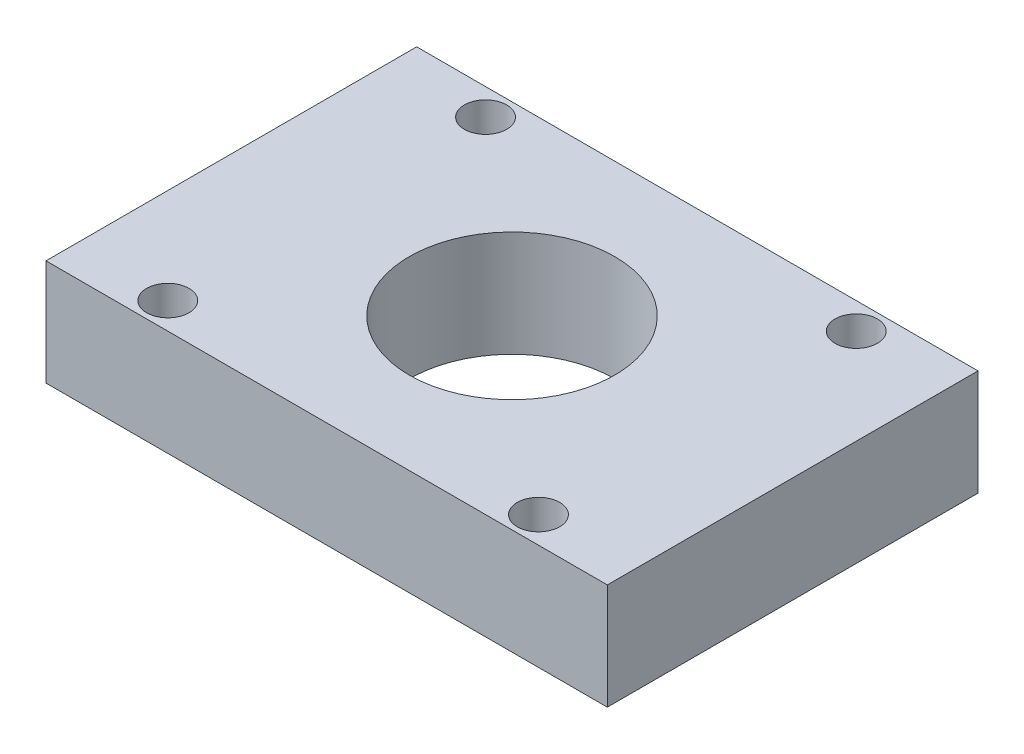
ISO-10303-21;
HEADER;
FILE_DESCRIPTION(('STEP AP214'),'2;1');
FILE_NAME('part.step','',(''),(''),'','','');
FILE_SCHEMA(('AUTOMOTIVE_DESIGN { 1 0 10303 214 1 1 1 1 }'));
ENDSEC;
DATA;
#1=APPLICATION_CONTEXT('core data for automotive mechanical design processes');
#2=APPLICATION_PROTOCOL_DEFINITION('international standard','automotive_design',2000,#1);
#3=PRODUCT_CONTEXT('',#1,'mechanical');
#4=PRODUCT('Part','Part','',(#3));
#5=PRODUCT_RELATED_PRODUCT_CATEGORY('part','',(#4));
#6=PRODUCT_DEFINITION_FORMATION('','',#4);
#7=PRODUCT_DEFINITION_CONTEXT('part definition',#1,'design');
#8=PRODUCT_DEFINITION('design','',#6,#7);
#9=PRODUCT_DEFINITION_SHAPE('','',#8);
#10=(LENGTH_UNIT() NAMED_UNIT(*) SI_UNIT(.MILLI.,.METRE.));
#11=(NAMED_UNIT(*) PLANE_ANGLE_UNIT() SI_UNIT($,.RADIAN.));
#12=(NAMED_UNIT(*) SI_UNIT($,.STERADIAN.) SOLID_ANGLE_UNIT());
#13=UNCERTAINTY_MEASURE_WITH_UNIT(LENGTH_MEASURE(1.E-05),#10,'distance_accuracy_value','');
#14=(GEOMETRIC_REPRESENTATION_CONTEXT(3) GLOBAL_UNCERTAINTY_ASSIGNED_CONTEXT((#13)) GLOBAL_UNIT_ASSIGNED_CONTEXT((#10,
#11,#12)) REPRESENTATION_CONTEXT('',''));
#15=CARTESIAN_POINT('',(0.,0.,0.));
#16=DIRECTION('',(0.,0.,1.));
#17=DIRECTION('',(1.,0.,0.));
#18=AXIS2_PLACEMENT_3D('',#15,#16,#17);
#19=CARTESIAN_POINT('',(26.5,10.,-17.5));
#20=DIRECTION('',(-1.,0.,0.));
#21=DIRECTION('',(0.,0.,1.));
#22=AXIS2_PLACEMENT_3D('',#19,#20,#21);
#23=PLANE('',#22);
#24=DIRECTION('',(0.,0.,-1.));
#25=VECTOR('',#24,1.);
#26=CARTESIAN_POINT('',(26.5,0.,-17.5));
#27=LINE('',#26,#25);
#28=CARTESIAN_POINT('',(26.5,0.,17.5));
#29=VERTEX_POINT('',#28);
#30=CARTESIAN_POINT('',(26.5,0.,-17.5));
#31=VERTEX_POINT('',#30);
#32=EDGE_CURVE('E111',#29,#31,#27,.T.);
#33=ORIENTED_EDGE('',*,*,#32,.T.);
#34=DIRECTION('',(0.,-1.,0.));
#35=VECTOR('',#34,1.);
#36=CARTESIAN_POINT('',(26.5,10.,-17.5));
#37=LINE('',#36,#35);
#38=CARTESIAN_POINT('',(26.5,10.,-17.5));
#39=VERTEX_POINT('',#38);
#40=EDGE_CURVE('E11',#39,#31,#37,.T.);
#41=ORIENTED_EDGE('',*,*,#40,.F.);
#42=DIRECTION('',(0.,0.,-1.));
#43=VECTOR('',#42,1.);
#44=CARTESIAN_POINT('',(26.5,10.,-17.5));
#45=LINE('',#44,#43);
#46=CARTESIAN_POINT('',(26.5,10.,17.5));
#47=VERTEX_POINT('',#46);
#48=EDGE_CURVE('E95',#47,#39,#45,.T.);
#49=ORIENTED_EDGE('',*,*,#48,.F.);
#50=DIRECTION('',(0.,-1.,0.));
#51=VECTOR('',#50,1.);
#52=CARTESIAN_POINT('',(26.5,10.,17.5));
#53=LINE('',#52,#51);
#54=EDGE_CURVE('E107',#47,#29,#53,.T.);
#55=ORIENTED_EDGE('',*,*,#54,.T.);
#56=EDGE_LOOP('',(#33,#41,#49,#55));
#57=FACE_BOUND('',#56,.T.);
#58=ADVANCED_FACE('F43',(#57),#23,.F.);
#59=CARTESIAN_POINT('',(-26.5,10.,-17.5));
#60=DIRECTION('',(0.,0.,1.));
#61=DIRECTION('',(1.,0.,0.));
#62=AXIS2_PLACEMENT_3D('',#59,#60,#61);
#63=PLANE('',#62);
#64=DIRECTION('',(-1.,0.,0.));
#65=VECTOR('',#64,1.);
#66=CARTESIAN_POINT('',(-26.5,0.,-17.5));
#67=LINE('',#66,#65);
#68=CARTESIAN_POINT('',(-26.5,0.,-17.5));
#69=VERTEX_POINT('',#68);
#70=EDGE_CURVE('E100',#31,#69,#67,.T.);
#71=ORIENTED_EDGE('',*,*,#70,.T.);
#72=DIRECTION('',(0.,-1.,0.));
#73=VECTOR('',#72,1.);
#74=CARTESIAN_POINT('',(-26.5,10.,-17.5));
#75=LINE('',#74,#73);
#76=CARTESIAN_POINT('',(-26.5,10.,-17.5));
#77=VERTEX_POINT('',#76);
#78=EDGE_CURVE('E52',#77,#69,#75,.T.);
#79=ORIENTED_EDGE('',*,*,#78,.F.);
#80=DIRECTION('',(-1.,0.,0.));
#81=VECTOR('',#80,1.);
#82=CARTESIAN_POINT('',(-26.5,10.,-17.5));
#83=LINE('',#82,#81);
#84=EDGE_CURVE('E90',#39,#77,#83,.T.);
#85=ORIENTED_EDGE('',*,*,#84,.F.);
#86=ORIENTED_EDGE('',*,*,#40,.T.);
#87=EDGE_LOOP('',(#71,#79,#85,#86));
#88=FACE_BOUND('',#87,.T.);
#89=ADVANCED_FACE('F99',(#88),#63,.F.);
#90=CARTESIAN_POINT('',(-26.5,10.,-17.5));
#91=DIRECTION('',(1.,0.,0.));
#92=DIRECTION('',(0.,0.,-1.));
#93=AXIS2_PLACEMENT_3D('',#90,#91,#92);
#94=PLANE('',#93);
#95=DIRECTION('',(0.,0.,1.));
#96=VECTOR('',#95,1.);
#97=CARTESIAN_POINT('',(-26.5,0.,-17.5));
#98=LINE('',#97,#96);
#99=CARTESIAN_POINT('',(-26.5,0.,17.5));
#100=VERTEX_POINT('',#99);
#101=EDGE_CURVE('E77',#69,#100,#98,.T.);
#102=ORIENTED_EDGE('',*,*,#101,.T.);
#103=DIRECTION('',(0.,-1.,0.));
#104=VECTOR('',#103,1.);
#105=CARTESIAN_POINT('',(-26.5,10.,17.5));
#106=LINE('',#105,#104);
#107=CARTESIAN_POINT('',(-26.5,10.,17.5));
#108=VERTEX_POINT('',#107);
#109=EDGE_CURVE('E102',#108,#100,#106,.T.);
#110=ORIENTED_EDGE('',*,*,#109,.F.);
#111=DIRECTION('',(0.,0.,1.));
#112=VECTOR('',#111,1.);
#113=CARTESIAN_POINT('',(-26.5,10.,-17.5));
#114=LINE('',#113,#112);
#115=EDGE_CURVE('E93',#77,#108,#114,.T.);
#116=ORIENTED_EDGE('',*,*,#115,.F.);
#117=ORIENTED_EDGE('',*,*,#78,.T.);
#118=EDGE_LOOP('',(#102,#110,#116,#117));
#119=FACE_BOUND('',#118,.T.);
#120=ADVANCED_FACE('F103',(#119),#94,.F.);
#121=CARTESIAN_POINT('',(-26.5,10.,17.5));
#122=DIRECTION('',(0.,0.,-1.));
#123=DIRECTION('',(-1.,0.,0.));
#124=AXIS2_PLACEMENT_3D('',#121,#122,#123);
#125=PLANE('',#124);
#126=DIRECTION('',(1.,0.,0.));
#127=VECTOR('',#126,1.);
#128=CARTESIAN_POINT('',(-26.5,0.,17.5));
#129=LINE('',#128,#127);
#130=EDGE_CURVE('E83',#100,#29,#129,.T.);
#131=ORIENTED_EDGE('',*,*,#130,.T.);
#132=ORIENTED_EDGE('',*,*,#54,.F.);
#133=DIRECTION('',(1.,0.,0.));
#134=VECTOR('',#133,1.);
#135=CARTESIAN_POINT('',(-26.5,10.,17.5));
#136=LINE('',#135,#134);
#137=EDGE_CURVE('E60',#108,#47,#136,.T.);
#138=ORIENTED_EDGE('',*,*,#137,.F.);
#139=ORIENTED_EDGE('',*,*,#109,.T.);
#140=EDGE_LOOP('',(#131,#132,#138,#139));
#141=FACE_BOUND('',#140,.T.);
#142=ADVANCED_FACE('F125',(#141),#125,.F.);
#143=CARTESIAN_POINT('',(0.,10.,0.));
#144=DIRECTION('',(0.,1.,0.));
#145=DIRECTION('',(0.,0.,1.));
#146=AXIS2_PLACEMENT_3D('',#143,#144,#145);
#147=PLANE('',#146);
#148=CARTESIAN_POINT('',(17.5,10.,-15.));
#149=DIRECTION('',(0.,1.,0.));
#150=DIRECTION('',(0.,0.,1.));
#151=AXIS2_PLACEMENT_3D('',#148,#149,#150);
#152=CIRCLE('',#151,2.);
#153=CARTESIAN_POINT('',(17.5,10.,-13.));
#154=VERTEX_POINT('',#153);
#155=EDGE_CURVE('E136',#154,#154,#152,.T.);
#156=ORIENTED_EDGE('',*,*,#155,.F.);
#157=EDGE_LOOP('',(#156));
#158=FACE_BOUND('',#157,.T.);
#159=CARTESIAN_POINT('',(-17.5,10.,15.));
#160=DIRECTION('',(0.,1.,0.));
#161=DIRECTION('',(0.,0.,1.));
#162=AXIS2_PLACEMENT_3D('',#159,#160,#161);
#163=CIRCLE('',#162,2.);
#164=CARTESIAN_POINT('',(-17.5,10.,17.));
#165=VERTEX_POINT('',#164);
#166=EDGE_CURVE('E144',#165,#165,#163,.T.);
#167=ORIENTED_EDGE('',*,*,#166,.F.);
#168=EDGE_LOOP('',(#167));
#169=FACE_BOUND('',#168,.T.);
#170=CARTESIAN_POINT('',(17.5,10.,15.));
#171=DIRECTION('',(0.,1.,0.));
#172=DIRECTION('',(0.,0.,1.));
#173=AXIS2_PLACEMENT_3D('',#170,#171,#172);
#174=CIRCLE('',#173,2.);
#175=CARTESIAN_POINT('',(17.5,10.,17.));
#176=VERTEX_POINT('',#175);
#177=EDGE_CURVE('E145',#176,#176,#174,.T.);
#178=ORIENTED_EDGE('',*,*,#177,.F.);
#179=EDGE_LOOP('',(#178));
#180=FACE_BOUND('',#179,.T.);
#181=CARTESIAN_POINT('',(0.,10.,0.));
#182=DIRECTION('',(0.,1.,0.));
#183=DIRECTION('',(0.,0.,1.));
#184=AXIS2_PLACEMENT_3D('',#181,#182,#183);
#185=CIRCLE('',#184,9.69923337418347);
#186=CARTESIAN_POINT('',(0.,10.,9.69923337418347));
#187=VERTEX_POINT('',#186);
#188=EDGE_CURVE('E160',#187,#187,#185,.T.);
#189=ORIENTED_EDGE('',*,*,#188,.F.);
#190=EDGE_LOOP('',(#189));
#191=FACE_BOUND('',#190,.T.);
#192=CARTESIAN_POINT('',(-17.5,10.,-15.));
#193=DIRECTION('',(0.,1.,0.));
#194=DIRECTION('',(0.,0.,1.));
#195=AXIS2_PLACEMENT_3D('',#192,#193,#194);
#196=CIRCLE('',#195,2.);
#197=CARTESIAN_POINT('',(-17.5,10.,-13.));
#198=VERTEX_POINT('',#197);
#199=EDGE_CURVE('E132',#198,#198,#196,.T.);
#200=ORIENTED_EDGE('',*,*,#199,.F.);
#201=EDGE_LOOP('',(#200));
#202=FACE_BOUND('',#201,.T.);
#203=ORIENTED_EDGE('',*,*,#48,.T.);
#204=ORIENTED_EDGE('',*,*,#84,.T.);
#205=ORIENTED_EDGE('',*,*,#115,.T.);
#206=ORIENTED_EDGE('',*,*,#137,.T.);
#207=EDGE_LOOP('',(#203,#204,#205,#206));
#208=FACE_BOUND('',#207,.T.);
#209=ADVANCED_FACE('F91',(#158,#169,#180,#191,#202,#208),#147,.T.);
#210=CARTESIAN_POINT('',(0.,0.,0.));
#211=DIRECTION('',(0.,1.,0.));
#212=DIRECTION('',(0.,0.,1.));
#213=AXIS2_PLACEMENT_3D('',#210,#211,#212);
#214=PLANE('',#213);
#215=CARTESIAN_POINT('',(17.5,0.,-15.));
#216=DIRECTION('',(0.,1.,0.));
#217=DIRECTION('',(0.,0.,1.));
#218=AXIS2_PLACEMENT_3D('',#215,#216,#217);
#219=CIRCLE('',#218,2.);
#220=CARTESIAN_POINT('',(17.5,0.,-13.));
#221=VERTEX_POINT('',#220);
#222=EDGE_CURVE('E149',#221,#221,#219,.T.);
#223=ORIENTED_EDGE('',*,*,#222,.T.);
#224=EDGE_LOOP('',(#223));
#225=FACE_BOUND('',#224,.T.);
#226=CARTESIAN_POINT('',(-17.5,0.,15.));
#227=DIRECTION('',(0.,1.,0.));
#228=DIRECTION('',(0.,0.,1.));
#229=AXIS2_PLACEMENT_3D('',#226,#227,#228);
#230=CIRCLE('',#229,2.);
#231=CARTESIAN_POINT('',(-17.5,0.,17.));
#232=VERTEX_POINT('',#231);
#233=EDGE_CURVE('E140',#232,#232,#230,.T.);
#234=ORIENTED_EDGE('',*,*,#233,.T.);
#235=EDGE_LOOP('',(#234));
#236=FACE_BOUND('',#235,.T.);
#237=CARTESIAN_POINT('',(17.5,0.,15.));
#238=DIRECTION('',(0.,1.,0.));
#239=DIRECTION('',(0.,0.,1.));
#240=AXIS2_PLACEMENT_3D('',#237,#238,#239);
#241=CIRCLE('',#240,2.);
#242=CARTESIAN_POINT('',(17.5,0.,17.));
#243=VERTEX_POINT('',#242);
#244=EDGE_CURVE('E164',#243,#243,#241,.T.);
#245=ORIENTED_EDGE('',*,*,#244,.T.);
#246=EDGE_LOOP('',(#245));
#247=FACE_BOUND('',#246,.T.);
#248=CARTESIAN_POINT('',(0.,0.,0.));
#249=DIRECTION('',(0.,1.,0.));
#250=DIRECTION('',(0.,0.,1.));
#251=AXIS2_PLACEMENT_3D('',#248,#249,#250);
#252=CIRCLE('',#251,9.69923337418347);
#253=CARTESIAN_POINT('',(0.,0.,9.69923337418347));
#254=VERTEX_POINT('',#253);
#255=EDGE_CURVE('E156',#254,#254,#252,.T.);
#256=ORIENTED_EDGE('',*,*,#255,.T.);
#257=EDGE_LOOP('',(#256));
#258=FACE_BOUND('',#257,.T.);
#259=CARTESIAN_POINT('',(-17.5,0.,-15.));
#260=DIRECTION('',(0.,1.,0.));
#261=DIRECTION('',(0.,0.,1.));
#262=AXIS2_PLACEMENT_3D('',#259,#260,#261);
#263=CIRCLE('',#262,2.);
#264=CARTESIAN_POINT('',(-17.5,0.,-13.));
#265=VERTEX_POINT('',#264);
#266=EDGE_CURVE('E115',#265,#265,#263,.T.);
#267=ORIENTED_EDGE('',*,*,#266,.T.);
#268=EDGE_LOOP('',(#267));
#269=FACE_BOUND('',#268,.T.);
#270=ORIENTED_EDGE('',*,*,#32,.F.);
#271=ORIENTED_EDGE('',*,*,#130,.F.);
#272=ORIENTED_EDGE('',*,*,#101,.F.);
#273=ORIENTED_EDGE('',*,*,#70,.F.);
#274=EDGE_LOOP('',(#270,#271,#272,#273));
#275=FACE_BOUND('',#274,.T.);
#276=ADVANCED_FACE('F128',(#225,#236,#247,#258,#269,#275),#214,.F.);
#277=CARTESIAN_POINT('',(-17.5,0.,-15.));
#278=DIRECTION('',(0.,1.,0.));
#279=DIRECTION('',(0.,0.,1.));
#280=AXIS2_PLACEMENT_3D('',#277,#278,#279);
#281=CYLINDRICAL_SURFACE('',#280,2.);
#282=ORIENTED_EDGE('',*,*,#266,.F.);
#283=EDGE_LOOP('',(#282));
#284=FACE_BOUND('',#283,.T.);
#285=ORIENTED_EDGE('',*,*,#199,.T.);
#286=EDGE_LOOP('',(#285));
#287=FACE_BOUND('',#286,.T.);
#288=ADVANCED_FACE('F182',(#284,#287),#281,.F.);
#289=CARTESIAN_POINT('',(0.,0.,0.));
#290=DIRECTION('',(0.,1.,0.));
#291=DIRECTION('',(0.,0.,1.));
#292=AXIS2_PLACEMENT_3D('',#289,#290,#291);
#293=CYLINDRICAL_SURFACE('',#292,9.69923337418347);
#294=ORIENTED_EDGE('',*,*,#255,.F.);
#295=EDGE_LOOP('',(#294));
#296=FACE_BOUND('',#295,.T.);
#297=ORIENTED_EDGE('',*,*,#188,.T.);
#298=EDGE_LOOP('',(#297));
#299=FACE_BOUND('',#298,.T.);
#300=ADVANCED_FACE('F184',(#296,#299),#293,.F.);
#301=CARTESIAN_POINT('',(17.5,0.,15.));
#302=DIRECTION('',(0.,1.,0.));
#303=DIRECTION('',(0.,0.,1.));
#304=AXIS2_PLACEMENT_3D('',#301,#302,#303);
#305=CYLINDRICAL_SURFACE('',#304,2.);
#306=ORIENTED_EDGE('',*,*,#244,.F.);
#307=EDGE_LOOP('',(#306));
#308=FACE_BOUND('',#307,.T.);
#309=ORIENTED_EDGE('',*,*,#177,.T.);
#310=EDGE_LOOP('',(#309));
#311=FACE_BOUND('',#310,.T.);
#312=ADVANCED_FACE('F172',(#308,#311),#305,.F.);
#313=CARTESIAN_POINT('',(-17.5,0.,15.));
#314=DIRECTION('',(0.,1.,0.));
#315=DIRECTION('',(0.,0.,1.));
#316=AXIS2_PLACEMENT_3D('',#313,#314,#315);
#317=CYLINDRICAL_SURFACE('',#316,2.);
#318=ORIENTED_EDGE('',*,*,#233,.F.);
#319=EDGE_LOOP('',(#318));
#320=FACE_BOUND('',#319,.T.);
#321=ORIENTED_EDGE('',*,*,#166,.T.);
#322=EDGE_LOOP('',(#321));
#323=FACE_BOUND('',#322,.T.);
#324=ADVANCED_FACE('F241',(#320,#323),#317,.F.);
#325=CARTESIAN_POINT('',(17.5,0.,-15.));
#326=DIRECTION('',(0.,1.,0.));
#327=DIRECTION('',(0.,0.,1.));
#328=AXIS2_PLACEMENT_3D('',#325,#326,#327);
#329=CYLINDRICAL_SURFACE('',#328,2.);
#330=ORIENTED_EDGE('',*,*,#222,.F.);
#331=EDGE_LOOP('',(#330));
#332=FACE_BOUND('',#331,.T.);
#333=ORIENTED_EDGE('',*,*,#155,.T.);
#334=EDGE_LOOP('',(#333));
#335=FACE_BOUND('',#334,.T.);
#336=ADVANCED_FACE('F252',(#332,#335),#329,.F.);
#337=CLOSED_SHELL('',(#58,#89,#120,#142,#209,#276,#288,#300,#312,#324,#336));
#338=MANIFOLD_SOLID_BREP('B2',#337);
#339=ADVANCED_BREP_SHAPE_REPRESENTATION('',(#18,#338),#14);
#340=SHAPE_DEFINITION_REPRESENTATION(#9,#339);
ENDSEC;
END-ISO-10303-21;
